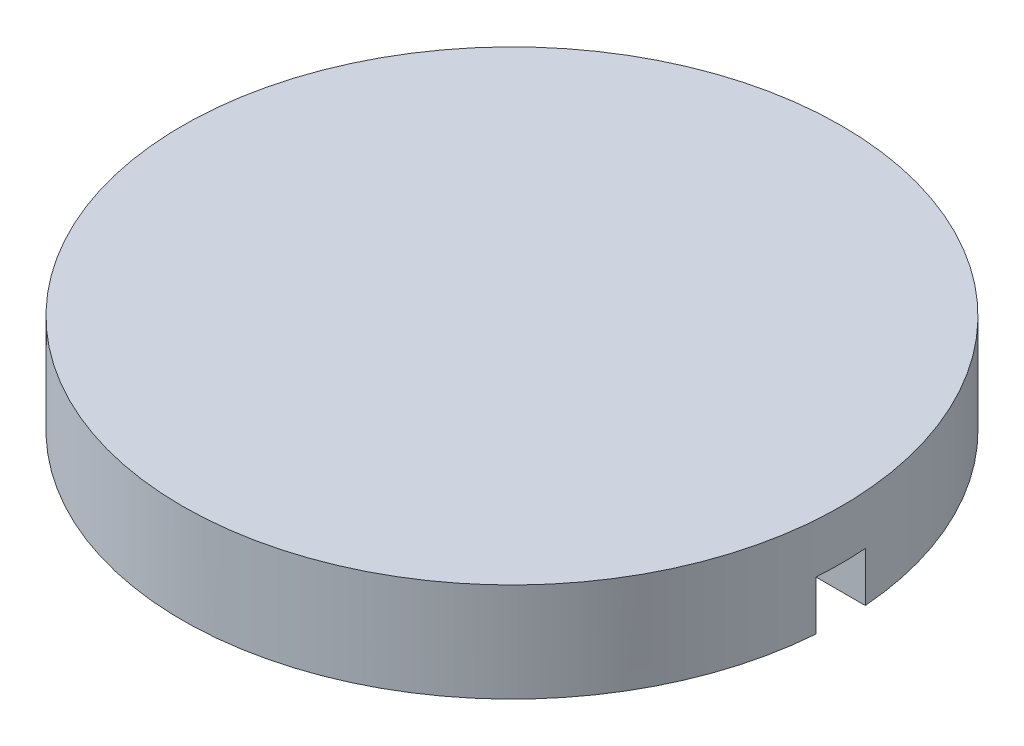
ISO-10303-21;
HEADER;
FILE_DESCRIPTION(('STEP AP214'),'2;1');
FILE_NAME('part.step','',(''),(''),'','','');
FILE_SCHEMA(('AUTOMOTIVE_DESIGN { 1 0 10303 214 1 1 1 1 }'));
ENDSEC;
DATA;
#1=APPLICATION_CONTEXT('core data for automotive mechanical design processes');
#2=APPLICATION_PROTOCOL_DEFINITION('international standard','automotive_design',2000,#1);
#3=PRODUCT_CONTEXT('',#1,'mechanical');
#4=PRODUCT('Part','Part','',(#3));
#5=PRODUCT_RELATED_PRODUCT_CATEGORY('part','',(#4));
#6=PRODUCT_DEFINITION_FORMATION('','',#4);
#7=PRODUCT_DEFINITION_CONTEXT('part definition',#1,'design');
#8=PRODUCT_DEFINITION('design','',#6,#7);
#9=PRODUCT_DEFINITION_SHAPE('','',#8);
#10=(LENGTH_UNIT() NAMED_UNIT(*) SI_UNIT(.MILLI.,.METRE.));
#11=(NAMED_UNIT(*) PLANE_ANGLE_UNIT() SI_UNIT($,.RADIAN.));
#12=(NAMED_UNIT(*) SI_UNIT($,.STERADIAN.) SOLID_ANGLE_UNIT());
#13=UNCERTAINTY_MEASURE_WITH_UNIT(LENGTH_MEASURE(1.E-05),#10,'distance_accuracy_value','');
#14=(GEOMETRIC_REPRESENTATION_CONTEXT(3) GLOBAL_UNCERTAINTY_ASSIGNED_CONTEXT((#13)) GLOBAL_UNIT_ASSIGNED_CONTEXT((#10,
#11,#12)) REPRESENTATION_CONTEXT('',''));
#15=CARTESIAN_POINT('',(0.,0.,0.));
#16=DIRECTION('',(0.,0.,1.));
#17=DIRECTION('',(1.,0.,0.));
#18=AXIS2_PLACEMENT_3D('',#15,#16,#17);
#19=CARTESIAN_POINT('',(200.,0.,0.));
#20=DIRECTION('',(0.,-1.,0.));
#21=DIRECTION('',(0.,0.,-1.));
#22=AXIS2_PLACEMENT_3D('',#19,#20,#21);
#23=PLANE('',#22);
#24=DIRECTION('',(-1.,0.,0.));
#25=VECTOR('',#24,1.);
#26=CARTESIAN_POINT('',(200.,0.,15.));
#27=LINE('',#26,#25);
#28=CARTESIAN_POINT('',(199.436706751791,0.,15.));
#29=VERTEX_POINT('',#28);
#30=CARTESIAN_POINT('',(-199.436706751791,0.,15.));
#31=VERTEX_POINT('',#30);
#32=EDGE_CURVE('E101',#29,#31,#27,.T.);
#33=ORIENTED_EDGE('',*,*,#32,.F.);
#34=CARTESIAN_POINT('',(0.,0.,0.));
#35=DIRECTION('',(0.,-1.,0.));
#36=DIRECTION('',(0.,0.,-1.));
#37=AXIS2_PLACEMENT_3D('',#34,#35,#36);
#38=CIRCLE('',#37,200.);
#39=EDGE_CURVE('E96',#29,#31,#38,.T.);
#40=ORIENTED_EDGE('',*,*,#39,.T.);
#41=EDGE_LOOP('',(#33,#40));
#42=FACE_BOUND('',#41,.T.);
#43=ADVANCED_FACE('F33',(#42),#23,.T.);
#44=CARTESIAN_POINT('',(0.,60.,0.));
#45=DIRECTION('',(0.,1.,0.));
#46=DIRECTION('',(0.,0.,1.));
#47=AXIS2_PLACEMENT_3D('',#44,#45,#46);
#48=PLANE('',#47);
#49=CARTESIAN_POINT('',(0.,60.,0.));
#50=DIRECTION('',(0.,-1.,0.));
#51=DIRECTION('',(0.,0.,-1.));
#52=AXIS2_PLACEMENT_3D('',#49,#50,#51);
#53=CIRCLE('',#52,200.);
#54=CARTESIAN_POINT('',(0.,60.,-200.));
#55=VERTEX_POINT('',#54);
#56=EDGE_CURVE('E97',#55,#55,#53,.T.);
#57=ORIENTED_EDGE('',*,*,#56,.F.);
#58=EDGE_LOOP('',(#57));
#59=FACE_BOUND('',#58,.T.);
#60=ADVANCED_FACE('F35',(#59),#48,.T.);
#61=CARTESIAN_POINT('',(0.,0.,0.));
#62=DIRECTION('',(0.,-1.,0.));
#63=DIRECTION('',(0.,0.,-1.));
#64=AXIS2_PLACEMENT_3D('',#61,#62,#63);
#65=CYLINDRICAL_SURFACE('',#64,200.);
#66=DIRECTION('',(0.,-1.,0.));
#67=VECTOR('',#66,1.);
#68=CARTESIAN_POINT('',(-199.436706751791,0.,15.));
#69=LINE('',#68,#67);
#70=CARTESIAN_POINT('',(-199.436706751791,30.,15.));
#71=VERTEX_POINT('',#70);
#72=EDGE_CURVE('E93',#31,#71,#69,.F.);
#73=ORIENTED_EDGE('',*,*,#72,.F.);
#74=ORIENTED_EDGE('',*,*,#39,.F.);
#75=DIRECTION('',(0.,-1.,0.));
#76=VECTOR('',#75,1.);
#77=CARTESIAN_POINT('',(199.436706751791,0.,15.));
#78=LINE('',#77,#76);
#79=CARTESIAN_POINT('',(199.436706751791,30.,15.));
#80=VERTEX_POINT('',#79);
#81=EDGE_CURVE('E88',#80,#29,#78,.T.);
#82=ORIENTED_EDGE('',*,*,#81,.F.);
#83=CARTESIAN_POINT('',(0.,30.,0.));
#84=DIRECTION('',(0.,1.,0.));
#85=DIRECTION('',(0.,0.,1.));
#86=AXIS2_PLACEMENT_3D('',#83,#84,#85);
#87=CIRCLE('',#86,200.);
#88=CARTESIAN_POINT('',(199.436706751791,30.,-15.));
#89=VERTEX_POINT('',#88);
#90=EDGE_CURVE('E37',#89,#80,#87,.F.);
#91=ORIENTED_EDGE('',*,*,#90,.F.);
#92=DIRECTION('',(0.,-1.,0.));
#93=VECTOR('',#92,1.);
#94=CARTESIAN_POINT('',(199.436706751791,0.,-15.));
#95=LINE('',#94,#93);
#96=CARTESIAN_POINT('',(199.436706751791,0.,-15.));
#97=VERTEX_POINT('',#96);
#98=EDGE_CURVE('E80',#97,#89,#95,.F.);
#99=ORIENTED_EDGE('',*,*,#98,.F.);
#100=CARTESIAN_POINT('',(-199.436706751791,0.,-15.));
#101=VERTEX_POINT('',#100);
#102=EDGE_CURVE('E86',#101,#97,#38,.T.);
#103=ORIENTED_EDGE('',*,*,#102,.F.);
#104=DIRECTION('',(0.,-1.,0.));
#105=VECTOR('',#104,1.);
#106=CARTESIAN_POINT('',(-199.436706751791,0.,-15.));
#107=LINE('',#106,#105);
#108=CARTESIAN_POINT('',(-199.436706751791,30.,-15.));
#109=VERTEX_POINT('',#108);
#110=EDGE_CURVE('E48',#109,#101,#107,.T.);
#111=ORIENTED_EDGE('',*,*,#110,.F.);
#112=EDGE_CURVE('E11',#71,#109,#87,.F.);
#113=ORIENTED_EDGE('',*,*,#112,.F.);
#114=EDGE_LOOP('',(#73,#74,#82,#91,#99,#103,#111,#113));
#115=FACE_BOUND('',#114,.T.);
#116=ORIENTED_EDGE('',*,*,#56,.T.);
#117=EDGE_LOOP('',(#116));
#118=FACE_BOUND('',#117,.T.);
#119=ADVANCED_FACE('F83',(#115,#118),#65,.T.);
#120=DIRECTION('',(1.,0.,0.));
#121=VECTOR('',#120,1.);
#122=CARTESIAN_POINT('',(200.,0.,-15.));
#123=LINE('',#122,#121);
#124=EDGE_CURVE('E100',#101,#97,#123,.T.);
#125=ORIENTED_EDGE('',*,*,#124,.F.);
#126=ORIENTED_EDGE('',*,*,#102,.T.);
#127=EDGE_LOOP('',(#125,#126));
#128=FACE_BOUND('',#127,.T.);
#129=ADVANCED_FACE('F111',(#128),#23,.T.);
#130=CARTESIAN_POINT('',(-200.,0.,15.));
#131=DIRECTION('',(0.,0.,1.));
#132=DIRECTION('',(1.,0.,0.));
#133=AXIS2_PLACEMENT_3D('',#130,#131,#132);
#134=PLANE('',#133);
#135=ORIENTED_EDGE('',*,*,#72,.T.);
#136=DIRECTION('',(1.,0.,0.));
#137=VECTOR('',#136,1.);
#138=CARTESIAN_POINT('',(-200.,30.,15.));
#139=LINE('',#138,#137);
#140=EDGE_CURVE('E73',#71,#80,#139,.T.);
#141=ORIENTED_EDGE('',*,*,#140,.T.);
#142=ORIENTED_EDGE('',*,*,#81,.T.);
#143=ORIENTED_EDGE('',*,*,#32,.T.);
#144=EDGE_LOOP('',(#135,#141,#142,#143));
#145=FACE_BOUND('',#144,.T.);
#146=ADVANCED_FACE('F104',(#145),#134,.F.);
#147=CARTESIAN_POINT('',(-200.,30.,15.));
#148=DIRECTION('',(0.,1.,0.));
#149=DIRECTION('',(0.,0.,1.));
#150=AXIS2_PLACEMENT_3D('',#147,#148,#149);
#151=PLANE('',#150);
#152=ORIENTED_EDGE('',*,*,#140,.F.);
#153=ORIENTED_EDGE('',*,*,#112,.T.);
#154=DIRECTION('',(1.,0.,0.));
#155=VECTOR('',#154,1.);
#156=CARTESIAN_POINT('',(-200.,30.,-15.));
#157=LINE('',#156,#155);
#158=EDGE_CURVE('E72',#109,#89,#157,.T.);
#159=ORIENTED_EDGE('',*,*,#158,.T.);
#160=ORIENTED_EDGE('',*,*,#90,.T.);
#161=EDGE_LOOP('',(#152,#153,#159,#160));
#162=FACE_BOUND('',#161,.T.);
#163=ADVANCED_FACE('F71',(#162),#151,.F.);
#164=CARTESIAN_POINT('',(-200.,0.,-15.));
#165=DIRECTION('',(0.,0.,-1.));
#166=DIRECTION('',(0.,1.,0.));
#167=AXIS2_PLACEMENT_3D('',#164,#165,#166);
#168=PLANE('',#167);
#169=ORIENTED_EDGE('',*,*,#98,.T.);
#170=ORIENTED_EDGE('',*,*,#158,.F.);
#171=ORIENTED_EDGE('',*,*,#110,.T.);
#172=ORIENTED_EDGE('',*,*,#124,.T.);
#173=EDGE_LOOP('',(#169,#170,#171,#172));
#174=FACE_BOUND('',#173,.T.);
#175=ADVANCED_FACE('F78',(#174),#168,.F.);
#176=CLOSED_SHELL('',(#43,#60,#119,#129,#146,#163,#175));
#177=MANIFOLD_SOLID_BREP('B2',#176);
#178=ADVANCED_BREP_SHAPE_REPRESENTATION('',(#18,#177),#14);
#179=SHAPE_DEFINITION_REPRESENTATION(#9,#178);
ENDSEC;
END-ISO-10303-21;
